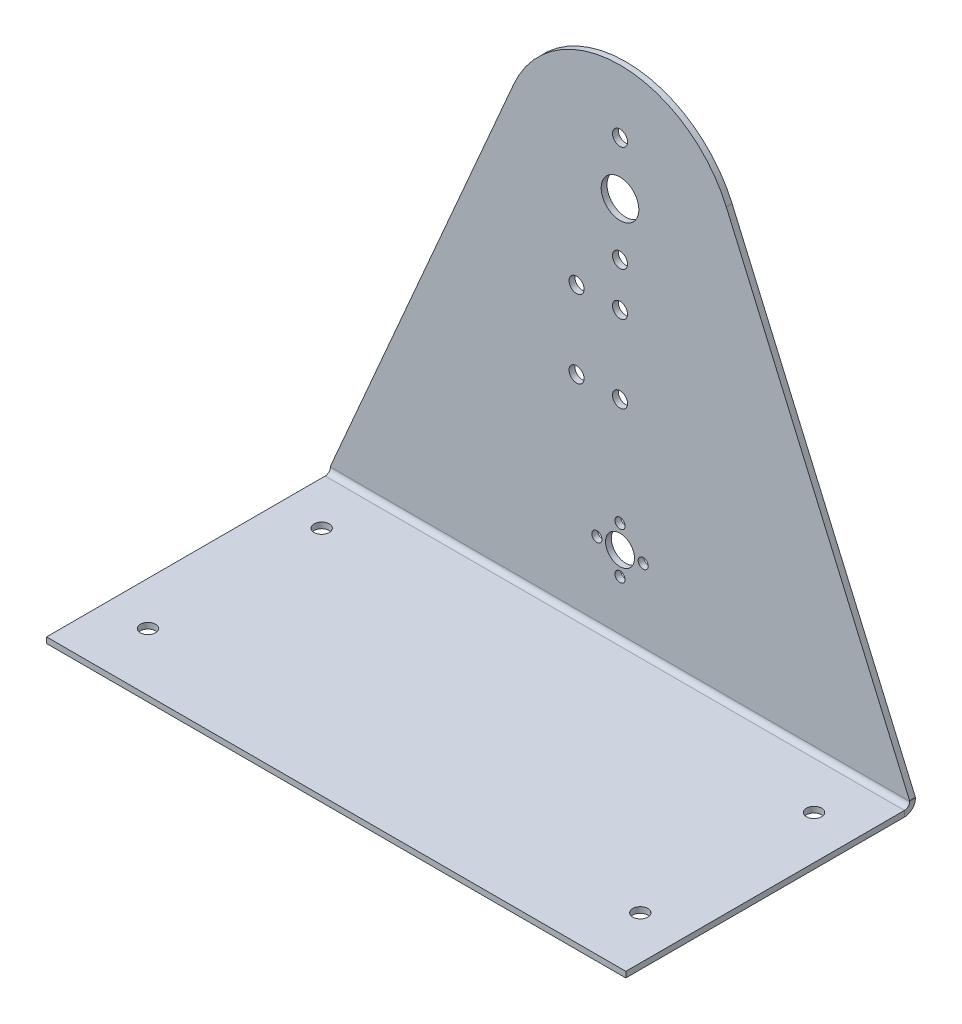
ISO-10303-21;
HEADER;
FILE_DESCRIPTION(('STEP AP214'),'2;1');
FILE_NAME('part.step','',(''),(''),'','','');
FILE_SCHEMA(('AUTOMOTIVE_DESIGN { 1 0 10303 214 1 1 1 1 }'));
ENDSEC;
DATA;
#1=APPLICATION_CONTEXT('core data for automotive mechanical design processes');
#2=APPLICATION_PROTOCOL_DEFINITION('international standard','automotive_design',2000,#1);
#3=PRODUCT_CONTEXT('',#1,'mechanical');
#4=PRODUCT('Part','Part','',(#3));
#5=PRODUCT_RELATED_PRODUCT_CATEGORY('part','',(#4));
#6=PRODUCT_DEFINITION_FORMATION('','',#4);
#7=PRODUCT_DEFINITION_CONTEXT('part definition',#1,'design');
#8=PRODUCT_DEFINITION('design','',#6,#7);
#9=PRODUCT_DEFINITION_SHAPE('','',#8);
#10=(LENGTH_UNIT() NAMED_UNIT(*) SI_UNIT(.MILLI.,.METRE.));
#11=(NAMED_UNIT(*) PLANE_ANGLE_UNIT() SI_UNIT($,.RADIAN.));
#12=(NAMED_UNIT(*) SI_UNIT($,.STERADIAN.) SOLID_ANGLE_UNIT());
#13=UNCERTAINTY_MEASURE_WITH_UNIT(LENGTH_MEASURE(1.E-05),#10,'distance_accuracy_value','');
#14=(GEOMETRIC_REPRESENTATION_CONTEXT(3) GLOBAL_UNCERTAINTY_ASSIGNED_CONTEXT((#13)) GLOBAL_UNIT_ASSIGNED_CONTEXT((#10,
#11,#12)) REPRESENTATION_CONTEXT('',''));
#15=CARTESIAN_POINT('',(0.,0.,0.));
#16=DIRECTION('',(0.,0.,1.));
#17=DIRECTION('',(1.,0.,0.));
#18=AXIS2_PLACEMENT_3D('',#15,#16,#17);
#19=CARTESIAN_POINT('',(-100.,0.,0.));
#20=DIRECTION('',(-1.,0.,0.));
#21=DIRECTION('',(0.,-1.,0.));
#22=AXIS2_PLACEMENT_3D('',#19,#20,#21);
#23=PLANE('',#22);
#24=DIRECTION('',(0.,0.,-1.));
#25=VECTOR('',#24,1.);
#26=CARTESIAN_POINT('',(-100.,-0.200000000000024,0.));
#27=LINE('',#26,#25);
#28=CARTESIAN_POINT('',(-100.,-0.200000000000025,2.));
#29=VERTEX_POINT('',#28);
#30=CARTESIAN_POINT('',(-100.,-0.200000000000024,0.));
#31=VERTEX_POINT('',#30);
#32=EDGE_CURVE('E11',#29,#31,#27,.T.);
#33=ORIENTED_EDGE('',*,*,#32,.F.);
#34=DIRECTION('',(0.,1.,0.));
#35=VECTOR('',#34,1.);
#36=CARTESIAN_POINT('',(-100.,0.,2.));
#37=LINE('',#36,#35);
#38=CARTESIAN_POINT('',(-100.,0.,2.));
#39=VERTEX_POINT('',#38);
#40=EDGE_CURVE('E104',#39,#29,#37,.F.);
#41=ORIENTED_EDGE('',*,*,#40,.F.);
#42=DIRECTION('',(0.,0.,-1.));
#43=VECTOR('',#42,1.);
#44=CARTESIAN_POINT('',(-100.,0.,0.));
#45=LINE('',#44,#43);
#46=CARTESIAN_POINT('',(-100.,0.,0.));
#47=VERTEX_POINT('',#46);
#48=EDGE_CURVE('E59',#39,#47,#45,.T.);
#49=ORIENTED_EDGE('',*,*,#48,.T.);
#50=DIRECTION('',(0.,-1.,0.));
#51=VECTOR('',#50,1.);
#52=CARTESIAN_POINT('',(-100.,0.,0.));
#53=LINE('',#52,#51);
#54=EDGE_CURVE('E106',#47,#31,#53,.T.);
#55=ORIENTED_EDGE('',*,*,#54,.T.);
#56=EDGE_LOOP('',(#33,#41,#49,#55));
#57=FACE_BOUND('',#56,.T.);
#58=ADVANCED_FACE('F49',(#57),#23,.T.);
#59=CARTESIAN_POINT('',(-84.1602695781019,36.5113130735037,0.));
#60=DIRECTION('',(0.917389064563678,-0.397991588125906,0.));
#61=DIRECTION('',(0.397991588125906,0.917389064563678,0.));
#62=AXIS2_PLACEMENT_3D('',#59,#60,#61);
#63=PLANE('',#62);
#64=ORIENTED_EDGE('',*,*,#48,.F.);
#65=DIRECTION('',(0.397991588125906,0.917389064563678,0.));
#66=VECTOR('',#65,1.);
#67=CARTESIAN_POINT('',(-84.1602695781019,36.5113130735037,2.));
#68=LINE('',#67,#66);
#69=CARTESIAN_POINT('',(-36.6955625825471,145.919663525036,2.));
#70=VERTEX_POINT('',#69);
#71=EDGE_CURVE('E131',#39,#70,#68,.T.);
#72=ORIENTED_EDGE('',*,*,#71,.T.);
#73=DIRECTION('',(0.,0.,-1.));
#74=VECTOR('',#73,1.);
#75=CARTESIAN_POINT('',(-36.6955625825471,145.919663525036,0.));
#76=LINE('',#75,#74);
#77=CARTESIAN_POINT('',(-36.6955625825471,145.919663525036,0.));
#78=VERTEX_POINT('',#77);
#79=EDGE_CURVE('E186',#70,#78,#76,.T.);
#80=ORIENTED_EDGE('',*,*,#79,.T.);
#81=DIRECTION('',(0.397991588125906,0.917389064563678,0.));
#82=VECTOR('',#81,1.);
#83=CARTESIAN_POINT('',(-84.1602695781019,36.5113130735037,0.));
#84=LINE('',#83,#82);
#85=EDGE_CURVE('E200',#47,#78,#84,.T.);
#86=ORIENTED_EDGE('',*,*,#85,.F.);
#87=EDGE_LOOP('',(#64,#72,#80,#86));
#88=FACE_BOUND('',#87,.T.);
#89=ADVANCED_FACE('F206',(#88),#63,.F.);
#90=CARTESIAN_POINT('',(0.,130.,0.));
#91=DIRECTION('',(0.,0.,1.));
#92=DIRECTION('',(1.,0.,0.));
#93=AXIS2_PLACEMENT_3D('',#90,#91,#92);
#94=CYLINDRICAL_SURFACE('',#93,40.);
#95=ORIENTED_EDGE('',*,*,#79,.F.);
#96=CARTESIAN_POINT('',(0.,130.,2.));
#97=DIRECTION('',(0.,0.,1.));
#98=DIRECTION('',(1.,0.,0.));
#99=AXIS2_PLACEMENT_3D('',#96,#97,#98);
#100=CIRCLE('',#99,40.);
#101=CARTESIAN_POINT('',(36.6955625825471,145.919663525036,2.));
#102=VERTEX_POINT('',#101);
#103=EDGE_CURVE('E248',#102,#70,#100,.T.);
#104=ORIENTED_EDGE('',*,*,#103,.F.);
#105=DIRECTION('',(0.,0.,-1.));
#106=VECTOR('',#105,1.);
#107=CARTESIAN_POINT('',(36.6955625825471,145.919663525036,0.));
#108=LINE('',#107,#106);
#109=CARTESIAN_POINT('',(36.6955625825471,145.919663525036,0.));
#110=VERTEX_POINT('',#109);
#111=EDGE_CURVE('E183',#102,#110,#108,.T.);
#112=ORIENTED_EDGE('',*,*,#111,.T.);
#113=CARTESIAN_POINT('',(0.,130.,0.));
#114=DIRECTION('',(0.,0.,1.));
#115=DIRECTION('',(1.,0.,0.));
#116=AXIS2_PLACEMENT_3D('',#113,#114,#115);
#117=CIRCLE('',#116,40.);
#118=EDGE_CURVE('E207',#110,#78,#117,.T.);
#119=ORIENTED_EDGE('',*,*,#118,.T.);
#120=EDGE_LOOP('',(#95,#104,#112,#119));
#121=FACE_BOUND('',#120,.T.);
#122=ADVANCED_FACE('F270',(#121),#94,.T.);
#123=CARTESIAN_POINT('',(84.1602695781019,36.5113130735037,0.));
#124=DIRECTION('',(0.917389064563678,0.397991588125906,0.));
#125=DIRECTION('',(-0.397991588125906,0.917389064563678,0.));
#126=AXIS2_PLACEMENT_3D('',#123,#124,#125);
#127=PLANE('',#126);
#128=ORIENTED_EDGE('',*,*,#111,.F.);
#129=DIRECTION('',(-0.397991588125906,0.917389064563678,0.));
#130=VECTOR('',#129,1.);
#131=CARTESIAN_POINT('',(84.1602695781019,36.5113130735037,2.));
#132=LINE('',#131,#130);
#133=CARTESIAN_POINT('',(100.,0.,2.));
#134=VERTEX_POINT('',#133);
#135=EDGE_CURVE('E168',#134,#102,#132,.T.);
#136=ORIENTED_EDGE('',*,*,#135,.F.);
#137=DIRECTION('',(0.,0.,-1.));
#138=VECTOR('',#137,1.);
#139=CARTESIAN_POINT('',(100.,0.,0.));
#140=LINE('',#139,#138);
#141=CARTESIAN_POINT('',(100.,0.,0.));
#142=VERTEX_POINT('',#141);
#143=EDGE_CURVE('E180',#134,#142,#140,.T.);
#144=ORIENTED_EDGE('',*,*,#143,.T.);
#145=DIRECTION('',(-0.397991588125906,0.917389064563678,0.));
#146=VECTOR('',#145,1.);
#147=CARTESIAN_POINT('',(84.1602695781019,36.5113130735037,0.));
#148=LINE('',#147,#146);
#149=EDGE_CURVE('E275',#142,#110,#148,.T.);
#150=ORIENTED_EDGE('',*,*,#149,.T.);
#151=EDGE_LOOP('',(#128,#136,#144,#150));
#152=FACE_BOUND('',#151,.T.);
#153=ADVANCED_FACE('F280',(#152),#127,.T.);
#154=CARTESIAN_POINT('',(100.,0.,0.));
#155=DIRECTION('',(-1.,0.,0.));
#156=DIRECTION('',(0.,-1.,0.));
#157=AXIS2_PLACEMENT_3D('',#154,#155,#156);
#158=PLANE('',#157);
#159=ORIENTED_EDGE('',*,*,#143,.F.);
#160=DIRECTION('',(0.,1.,0.));
#161=VECTOR('',#160,1.);
#162=CARTESIAN_POINT('',(100.,0.,2.));
#163=LINE('',#162,#161);
#164=CARTESIAN_POINT('',(100.,-0.199999999999964,2.));
#165=VERTEX_POINT('',#164);
#166=EDGE_CURVE('E132',#134,#165,#163,.F.);
#167=ORIENTED_EDGE('',*,*,#166,.T.);
#168=DIRECTION('',(0.,0.,-1.));
#169=VECTOR('',#168,1.);
#170=CARTESIAN_POINT('',(100.,-0.199999999999964,0.));
#171=LINE('',#170,#169);
#172=CARTESIAN_POINT('',(100.,-0.199999999999964,0.));
#173=VERTEX_POINT('',#172);
#174=EDGE_CURVE('E177',#165,#173,#171,.T.);
#175=ORIENTED_EDGE('',*,*,#174,.T.);
#176=DIRECTION('',(0.,-1.,0.));
#177=VECTOR('',#176,1.);
#178=CARTESIAN_POINT('',(100.,0.,0.));
#179=LINE('',#178,#177);
#180=EDGE_CURVE('E204',#142,#173,#179,.T.);
#181=ORIENTED_EDGE('',*,*,#180,.F.);
#182=EDGE_LOOP('',(#159,#167,#175,#181));
#183=FACE_BOUND('',#182,.T.);
#184=ADVANCED_FACE('F456',(#183),#158,.F.);
#185=CARTESIAN_POINT('',(100.,-0.199999999999964,3.8));
#186=DIRECTION('',(1.,0.,0.));
#187=DIRECTION('',(0.,0.,-1.));
#188=AXIS2_PLACEMENT_3D('',#185,#186,#187);
#189=PLANE('',#188);
#190=ORIENTED_EDGE('',*,*,#174,.F.);
#191=CARTESIAN_POINT('',(100.,-0.199999999999964,3.8));
#192=DIRECTION('',(1.,0.,0.));
#193=DIRECTION('',(0.,1.,0.));
#194=AXIS2_PLACEMENT_3D('',#191,#192,#193);
#195=CIRCLE('',#194,1.8);
#196=CARTESIAN_POINT('',(100.,-1.99999999999996,3.8));
#197=VERTEX_POINT('',#196);
#198=EDGE_CURVE('E120',#165,#197,#195,.F.);
#199=ORIENTED_EDGE('',*,*,#198,.T.);
#200=DIRECTION('',(0.,-1.,0.));
#201=VECTOR('',#200,1.);
#202=CARTESIAN_POINT('',(100.,-3.99999999999996,3.8));
#203=LINE('',#202,#201);
#204=CARTESIAN_POINT('',(100.,-3.99999999999996,3.8));
#205=VERTEX_POINT('',#204);
#206=EDGE_CURVE('E175',#197,#205,#203,.T.);
#207=ORIENTED_EDGE('',*,*,#206,.T.);
#208=CARTESIAN_POINT('',(100.,-0.199999999999964,3.8));
#209=DIRECTION('',(-1.,0.,0.));
#210=DIRECTION('',(0.,0.,1.));
#211=AXIS2_PLACEMENT_3D('',#208,#209,#210);
#212=CIRCLE('',#211,3.8);
#213=EDGE_CURVE('E239',#173,#205,#212,.T.);
#214=ORIENTED_EDGE('',*,*,#213,.F.);
#215=EDGE_LOOP('',(#190,#199,#207,#214));
#216=FACE_BOUND('',#215,.T.);
#217=ADVANCED_FACE('F452',(#216),#189,.T.);
#218=CARTESIAN_POINT('',(100.,-3.99999999999996,4.));
#219=DIRECTION('',(-1.,0.,0.));
#220=DIRECTION('',(0.,0.,-1.));
#221=AXIS2_PLACEMENT_3D('',#218,#219,#220);
#222=PLANE('',#221);
#223=ORIENTED_EDGE('',*,*,#206,.F.);
#224=DIRECTION('',(0.,0.,1.));
#225=VECTOR('',#224,1.);
#226=CARTESIAN_POINT('',(100.,-1.99999999999996,4.));
#227=LINE('',#226,#225);
#228=CARTESIAN_POINT('',(100.,-1.99999999999996,100.));
#229=VERTEX_POINT('',#228);
#230=EDGE_CURVE('E257',#229,#197,#227,.F.);
#231=ORIENTED_EDGE('',*,*,#230,.F.);
#232=DIRECTION('',(0.,-1.,0.));
#233=VECTOR('',#232,1.);
#234=CARTESIAN_POINT('',(100.,-3.99999999999996,100.));
#235=LINE('',#234,#233);
#236=CARTESIAN_POINT('',(100.,-3.99999999999996,100.));
#237=VERTEX_POINT('',#236);
#238=EDGE_CURVE('E172',#229,#237,#235,.T.);
#239=ORIENTED_EDGE('',*,*,#238,.T.);
#240=DIRECTION('',(0.,0.,-1.));
#241=VECTOR('',#240,1.);
#242=CARTESIAN_POINT('',(100.,-3.99999999999996,4.));
#243=LINE('',#242,#241);
#244=EDGE_CURVE('E224',#237,#205,#243,.T.);
#245=ORIENTED_EDGE('',*,*,#244,.T.);
#246=EDGE_LOOP('',(#223,#231,#239,#245));
#247=FACE_BOUND('',#246,.T.);
#248=ADVANCED_FACE('F448',(#247),#222,.F.);
#249=CARTESIAN_POINT('',(100.,-3.99999999999996,100.));
#250=DIRECTION('',(0.,0.,1.));
#251=DIRECTION('',(-1.,0.,0.));
#252=AXIS2_PLACEMENT_3D('',#249,#250,#251);
#253=PLANE('',#252);
#254=ORIENTED_EDGE('',*,*,#238,.F.);
#255=DIRECTION('',(1.,0.,0.));
#256=VECTOR('',#255,1.);
#257=CARTESIAN_POINT('',(100.,-1.99999999999996,100.));
#258=LINE('',#257,#256);
#259=CARTESIAN_POINT('',(-100.,-2.00000000000002,100.));
#260=VERTEX_POINT('',#259);
#261=EDGE_CURVE('E259',#229,#260,#258,.F.);
#262=ORIENTED_EDGE('',*,*,#261,.T.);
#263=DIRECTION('',(0.,-1.,0.));
#264=VECTOR('',#263,1.);
#265=CARTESIAN_POINT('',(-100.,-4.00000000000002,100.));
#266=LINE('',#265,#264);
#267=CARTESIAN_POINT('',(-100.,-4.00000000000002,100.));
#268=VERTEX_POINT('',#267);
#269=EDGE_CURVE('E169',#260,#268,#266,.T.);
#270=ORIENTED_EDGE('',*,*,#269,.T.);
#271=DIRECTION('',(-1.,0.,0.));
#272=VECTOR('',#271,1.);
#273=CARTESIAN_POINT('',(100.,-3.99999999999996,100.));
#274=LINE('',#273,#272);
#275=EDGE_CURVE('E227',#237,#268,#274,.T.);
#276=ORIENTED_EDGE('',*,*,#275,.F.);
#277=EDGE_LOOP('',(#254,#262,#270,#276));
#278=FACE_BOUND('',#277,.T.);
#279=ADVANCED_FACE('F445',(#278),#253,.T.);
#280=CARTESIAN_POINT('',(-100.,-4.00000000000002,4.));
#281=DIRECTION('',(-1.,0.,0.));
#282=DIRECTION('',(0.,0.,-1.));
#283=AXIS2_PLACEMENT_3D('',#280,#281,#282);
#284=PLANE('',#283);
#285=ORIENTED_EDGE('',*,*,#269,.F.);
#286=DIRECTION('',(0.,0.,1.));
#287=VECTOR('',#286,1.);
#288=CARTESIAN_POINT('',(-100.,-2.00000000000002,4.));
#289=LINE('',#288,#287);
#290=CARTESIAN_POINT('',(-100.,-2.00000000000002,3.8));
#291=VERTEX_POINT('',#290);
#292=EDGE_CURVE('E125',#260,#291,#289,.F.);
#293=ORIENTED_EDGE('',*,*,#292,.T.);
#294=DIRECTION('',(0.,-1.,0.));
#295=VECTOR('',#294,1.);
#296=CARTESIAN_POINT('',(-100.,-4.00000000000002,3.8));
#297=LINE('',#296,#295);
#298=CARTESIAN_POINT('',(-100.,-4.00000000000002,3.8));
#299=VERTEX_POINT('',#298);
#300=EDGE_CURVE('E53',#291,#299,#297,.T.);
#301=ORIENTED_EDGE('',*,*,#300,.T.);
#302=DIRECTION('',(0.,0.,-1.));
#303=VECTOR('',#302,1.);
#304=CARTESIAN_POINT('',(-100.,-4.00000000000002,4.));
#305=LINE('',#304,#303);
#306=EDGE_CURVE('E230',#268,#299,#305,.T.);
#307=ORIENTED_EDGE('',*,*,#306,.F.);
#308=EDGE_LOOP('',(#285,#293,#301,#307));
#309=FACE_BOUND('',#308,.T.);
#310=ADVANCED_FACE('F383',(#309),#284,.T.);
#311=CARTESIAN_POINT('',(0.,33.,0.));
#312=DIRECTION('',(0.,0.,1.));
#313=DIRECTION('',(1.,0.,0.));
#314=AXIS2_PLACEMENT_3D('',#311,#312,#313);
#315=CYLINDRICAL_SURFACE('',#314,1.75);
#316=CARTESIAN_POINT('',(0.,33.,0.));
#317=DIRECTION('',(0.,0.,1.));
#318=DIRECTION('',(1.,0.,0.));
#319=AXIS2_PLACEMENT_3D('',#316,#317,#318);
#320=CIRCLE('',#319,1.75);
#321=CARTESIAN_POINT('',(1.75,33.,0.));
#322=VERTEX_POINT('',#321);
#323=EDGE_CURVE('E242',#322,#322,#320,.T.);
#324=ORIENTED_EDGE('',*,*,#323,.F.);
#325=EDGE_LOOP('',(#324));
#326=FACE_BOUND('',#325,.T.);
#327=CARTESIAN_POINT('',(0.,33.,2.));
#328=DIRECTION('',(0.,0.,1.));
#329=DIRECTION('',(1.,0.,0.));
#330=AXIS2_PLACEMENT_3D('',#327,#328,#329);
#331=CIRCLE('',#330,1.75);
#332=CARTESIAN_POINT('',(1.75,33.,2.));
#333=VERTEX_POINT('',#332);
#334=EDGE_CURVE('E138',#333,#333,#331,.T.);
#335=ORIENTED_EDGE('',*,*,#334,.T.);
#336=EDGE_LOOP('',(#335));
#337=FACE_BOUND('',#336,.T.);
#338=ADVANCED_FACE('F379',(#326,#337),#315,.F.);
#339=CARTESIAN_POINT('',(0.,17.,0.));
#340=DIRECTION('',(0.,0.,1.));
#341=DIRECTION('',(1.,0.,0.));
#342=AXIS2_PLACEMENT_3D('',#339,#340,#341);
#343=CYLINDRICAL_SURFACE('',#342,1.75);
#344=CARTESIAN_POINT('',(0.,17.,0.));
#345=DIRECTION('',(0.,0.,1.));
#346=DIRECTION('',(1.,0.,0.));
#347=AXIS2_PLACEMENT_3D('',#344,#345,#346);
#348=CIRCLE('',#347,1.75);
#349=CARTESIAN_POINT('',(1.75,17.,0.));
#350=VERTEX_POINT('',#349);
#351=EDGE_CURVE('E301',#350,#350,#348,.T.);
#352=ORIENTED_EDGE('',*,*,#351,.F.);
#353=EDGE_LOOP('',(#352));
#354=FACE_BOUND('',#353,.T.);
#355=CARTESIAN_POINT('',(0.,17.,2.));
#356=DIRECTION('',(0.,0.,1.));
#357=DIRECTION('',(1.,0.,0.));
#358=AXIS2_PLACEMENT_3D('',#355,#356,#357);
#359=CIRCLE('',#358,1.75);
#360=CARTESIAN_POINT('',(1.75,17.,2.));
#361=VERTEX_POINT('',#360);
#362=EDGE_CURVE('E147',#361,#361,#359,.T.);
#363=ORIENTED_EDGE('',*,*,#362,.T.);
#364=EDGE_LOOP('',(#363));
#365=FACE_BOUND('',#364,.T.);
#366=ADVANCED_FACE('F382',(#354,#365),#343,.F.);
#367=CARTESIAN_POINT('',(8.,25.,0.));
#368=DIRECTION('',(0.,0.,1.));
#369=DIRECTION('',(1.,0.,0.));
#370=AXIS2_PLACEMENT_3D('',#367,#368,#369);
#371=CYLINDRICAL_SURFACE('',#370,1.75);
#372=CARTESIAN_POINT('',(8.,25.,0.));
#373=DIRECTION('',(0.,0.,1.));
#374=DIRECTION('',(1.,0.,0.));
#375=AXIS2_PLACEMENT_3D('',#372,#373,#374);
#376=CIRCLE('',#375,1.75);
#377=CARTESIAN_POINT('',(9.75,25.,0.));
#378=VERTEX_POINT('',#377);
#379=EDGE_CURVE('E298',#378,#378,#376,.T.);
#380=ORIENTED_EDGE('',*,*,#379,.F.);
#381=EDGE_LOOP('',(#380));
#382=FACE_BOUND('',#381,.T.);
#383=CARTESIAN_POINT('',(8.,25.,2.));
#384=DIRECTION('',(0.,0.,1.));
#385=DIRECTION('',(1.,0.,0.));
#386=AXIS2_PLACEMENT_3D('',#383,#384,#385);
#387=CIRCLE('',#386,1.75);
#388=CARTESIAN_POINT('',(9.75,25.,2.));
#389=VERTEX_POINT('',#388);
#390=EDGE_CURVE('E150',#389,#389,#387,.T.);
#391=ORIENTED_EDGE('',*,*,#390,.T.);
#392=EDGE_LOOP('',(#391));
#393=FACE_BOUND('',#392,.T.);
#394=ADVANCED_FACE('F387',(#382,#393),#371,.F.);
#395=CARTESIAN_POINT('',(-8.,25.,0.));
#396=DIRECTION('',(0.,0.,1.));
#397=DIRECTION('',(1.,0.,0.));
#398=AXIS2_PLACEMENT_3D('',#395,#396,#397);
#399=CYLINDRICAL_SURFACE('',#398,1.75);
#400=CARTESIAN_POINT('',(-8.,25.,0.));
#401=DIRECTION('',(0.,0.,1.));
#402=DIRECTION('',(1.,0.,0.));
#403=AXIS2_PLACEMENT_3D('',#400,#401,#402);
#404=CIRCLE('',#403,1.75);
#405=CARTESIAN_POINT('',(-6.25,25.,0.));
#406=VERTEX_POINT('',#405);
#407=EDGE_CURVE('E295',#406,#406,#404,.T.);
#408=ORIENTED_EDGE('',*,*,#407,.F.);
#409=EDGE_LOOP('',(#408));
#410=FACE_BOUND('',#409,.T.);
#411=CARTESIAN_POINT('',(-8.,25.,2.));
#412=DIRECTION('',(0.,0.,1.));
#413=DIRECTION('',(1.,0.,0.));
#414=AXIS2_PLACEMENT_3D('',#411,#412,#413);
#415=CIRCLE('',#414,1.75);
#416=CARTESIAN_POINT('',(-6.25,25.,2.));
#417=VERTEX_POINT('',#416);
#418=EDGE_CURVE('E153',#417,#417,#415,.T.);
#419=ORIENTED_EDGE('',*,*,#418,.T.);
#420=EDGE_LOOP('',(#419));
#421=FACE_BOUND('',#420,.T.);
#422=ADVANCED_FACE('F391',(#410,#421),#399,.F.);
#423=CARTESIAN_POINT('',(0.,25.,0.));
#424=DIRECTION('',(0.,0.,1.));
#425=DIRECTION('',(1.,0.,0.));
#426=AXIS2_PLACEMENT_3D('',#423,#424,#425);
#427=CYLINDRICAL_SURFACE('',#426,5.);
#428=CARTESIAN_POINT('',(0.,25.,0.));
#429=DIRECTION('',(0.,0.,1.));
#430=DIRECTION('',(1.,0.,0.));
#431=AXIS2_PLACEMENT_3D('',#428,#429,#430);
#432=CIRCLE('',#431,5.);
#433=CARTESIAN_POINT('',(5.,25.,0.));
#434=VERTEX_POINT('',#433);
#435=EDGE_CURVE('E292',#434,#434,#432,.T.);
#436=ORIENTED_EDGE('',*,*,#435,.F.);
#437=EDGE_LOOP('',(#436));
#438=FACE_BOUND('',#437,.T.);
#439=CARTESIAN_POINT('',(0.,25.,2.));
#440=DIRECTION('',(0.,0.,1.));
#441=DIRECTION('',(1.,0.,0.));
#442=AXIS2_PLACEMENT_3D('',#439,#440,#441);
#443=CIRCLE('',#442,5.);
#444=CARTESIAN_POINT('',(5.,25.,2.));
#445=VERTEX_POINT('',#444);
#446=EDGE_CURVE('E156',#445,#445,#443,.T.);
#447=ORIENTED_EDGE('',*,*,#446,.T.);
#448=EDGE_LOOP('',(#447));
#449=FACE_BOUND('',#448,.T.);
#450=ADVANCED_FACE('F395',(#438,#449),#427,.F.);
#451=CARTESIAN_POINT('',(0.,111.75,0.));
#452=DIRECTION('',(0.,0.,1.));
#453=DIRECTION('',(1.,0.,0.));
#454=AXIS2_PLACEMENT_3D('',#451,#452,#453);
#455=CYLINDRICAL_SURFACE('',#454,2.6);
#456=CARTESIAN_POINT('',(0.,111.75,0.));
#457=DIRECTION('',(0.,0.,-1.));
#458=DIRECTION('',(-1.,0.,0.));
#459=AXIS2_PLACEMENT_3D('',#456,#457,#458);
#460=CIRCLE('',#459,2.6);
#461=CARTESIAN_POINT('',(-2.6,111.75,0.));
#462=VERTEX_POINT('',#461);
#463=EDGE_CURVE('E289',#462,#462,#460,.T.);
#464=ORIENTED_EDGE('',*,*,#463,.T.);
#465=EDGE_LOOP('',(#464));
#466=FACE_BOUND('',#465,.T.);
#467=CARTESIAN_POINT('',(0.,111.75,2.));
#468=DIRECTION('',(0.,0.,-1.));
#469=DIRECTION('',(-1.,0.,0.));
#470=AXIS2_PLACEMENT_3D('',#467,#468,#469);
#471=CIRCLE('',#470,2.6);
#472=CARTESIAN_POINT('',(-2.6,111.75,2.));
#473=VERTEX_POINT('',#472);
#474=EDGE_CURVE('E159',#473,#473,#471,.T.);
#475=ORIENTED_EDGE('',*,*,#474,.F.);
#476=EDGE_LOOP('',(#475));
#477=FACE_BOUND('',#476,.T.);
#478=ADVANCED_FACE('F364',(#466,#477),#455,.F.);
#479=CARTESIAN_POINT('',(0.,148.25,0.));
#480=DIRECTION('',(0.,0.,1.));
#481=DIRECTION('',(1.,0.,0.));
#482=AXIS2_PLACEMENT_3D('',#479,#480,#481);
#483=CYLINDRICAL_SURFACE('',#482,2.59999999999999);
#484=CARTESIAN_POINT('',(0.,148.25,0.));
#485=DIRECTION('',(0.,0.,-1.));
#486=DIRECTION('',(-1.,0.,0.));
#487=AXIS2_PLACEMENT_3D('',#484,#485,#486);
#488=CIRCLE('',#487,2.59999999999999);
#489=CARTESIAN_POINT('',(-2.59999999999999,148.25,0.));
#490=VERTEX_POINT('',#489);
#491=EDGE_CURVE('E284',#490,#490,#488,.T.);
#492=ORIENTED_EDGE('',*,*,#491,.T.);
#493=EDGE_LOOP('',(#492));
#494=FACE_BOUND('',#493,.T.);
#495=CARTESIAN_POINT('',(0.,148.25,2.));
#496=DIRECTION('',(0.,0.,-1.));
#497=DIRECTION('',(-1.,0.,0.));
#498=AXIS2_PLACEMENT_3D('',#495,#496,#497);
#499=CIRCLE('',#498,2.59999999999999);
#500=CARTESIAN_POINT('',(-2.59999999999999,148.25,2.));
#501=VERTEX_POINT('',#500);
#502=EDGE_CURVE('E162',#501,#501,#499,.T.);
#503=ORIENTED_EDGE('',*,*,#502,.F.);
#504=EDGE_LOOP('',(#503));
#505=FACE_BOUND('',#504,.T.);
#506=ADVANCED_FACE('F355',(#494,#505),#483,.F.);
#507=CARTESIAN_POINT('',(0.,130.,0.));
#508=DIRECTION('',(0.,0.,1.));
#509=DIRECTION('',(1.,0.,0.));
#510=AXIS2_PLACEMENT_3D('',#507,#508,#509);
#511=CYLINDRICAL_SURFACE('',#510,6.50000000000001);
#512=CARTESIAN_POINT('',(0.,130.,0.));
#513=DIRECTION('',(0.,0.,1.));
#514=DIRECTION('',(1.,0.,0.));
#515=AXIS2_PLACEMENT_3D('',#512,#513,#514);
#516=CIRCLE('',#515,6.50000000000001);
#517=CARTESIAN_POINT('',(6.50000000000001,130.,0.));
#518=VERTEX_POINT('',#517);
#519=EDGE_CURVE('E281',#518,#518,#516,.T.);
#520=ORIENTED_EDGE('',*,*,#519,.F.);
#521=EDGE_LOOP('',(#520));
#522=FACE_BOUND('',#521,.T.);
#523=CARTESIAN_POINT('',(0.,130.,2.));
#524=DIRECTION('',(0.,0.,1.));
#525=DIRECTION('',(1.,0.,0.));
#526=AXIS2_PLACEMENT_3D('',#523,#524,#525);
#527=CIRCLE('',#526,6.50000000000001);
#528=CARTESIAN_POINT('',(6.50000000000001,130.,2.));
#529=VERTEX_POINT('',#528);
#530=EDGE_CURVE('E165',#529,#529,#527,.T.);
#531=ORIENTED_EDGE('',*,*,#530,.T.);
#532=EDGE_LOOP('',(#531));
#533=FACE_BOUND('',#532,.T.);
#534=ADVANCED_FACE('F51',(#522,#533),#511,.F.);
#535=CARTESIAN_POINT('',(-85.,-4.00000000000002,20.));
#536=DIRECTION('',(0.,-1.,0.));
#537=DIRECTION('',(1.,0.,0.));
#538=AXIS2_PLACEMENT_3D('',#535,#536,#537);
#539=CYLINDRICAL_SURFACE('',#538,2.6);
#540=CARTESIAN_POINT('',(-85.,-4.00000000000002,20.));
#541=DIRECTION('',(0.,-1.,0.));
#542=DIRECTION('',(1.,0.,0.));
#543=AXIS2_PLACEMENT_3D('',#540,#541,#542);
#544=CIRCLE('',#543,2.6);
#545=CARTESIAN_POINT('',(-82.4,-4.00000000000002,20.));
#546=VERTEX_POINT('',#545);
#547=EDGE_CURVE('E209',#546,#546,#544,.T.);
#548=ORIENTED_EDGE('',*,*,#547,.T.);
#549=EDGE_LOOP('',(#548));
#550=FACE_BOUND('',#549,.T.);
#551=CARTESIAN_POINT('',(-85.,-2.00000000000002,20.));
#552=DIRECTION('',(0.,-1.,0.));
#553=DIRECTION('',(1.,0.,0.));
#554=AXIS2_PLACEMENT_3D('',#551,#552,#553);
#555=CIRCLE('',#554,2.6);
#556=CARTESIAN_POINT('',(-82.4,-2.00000000000002,20.));
#557=VERTEX_POINT('',#556);
#558=EDGE_CURVE('E244',#557,#557,#555,.T.);
#559=ORIENTED_EDGE('',*,*,#558,.F.);
#560=EDGE_LOOP('',(#559));
#561=FACE_BOUND('',#560,.T.);
#562=ADVANCED_FACE('F354',(#550,#561),#539,.F.);
#563=CARTESIAN_POINT('',(85.,-3.99999999999996,80.));
#564=DIRECTION('',(0.,-1.,0.));
#565=DIRECTION('',(1.,0.,0.));
#566=AXIS2_PLACEMENT_3D('',#563,#564,#565);
#567=CYLINDRICAL_SURFACE('',#566,2.6);
#568=CARTESIAN_POINT('',(85.,-3.99999999999996,80.));
#569=DIRECTION('',(0.,-1.,0.));
#570=DIRECTION('',(1.,0.,0.));
#571=AXIS2_PLACEMENT_3D('',#568,#569,#570);
#572=CIRCLE('',#571,2.6);
#573=CARTESIAN_POINT('',(87.6,-3.99999999999996,80.));
#574=VERTEX_POINT('',#573);
#575=EDGE_CURVE('E215',#574,#574,#572,.T.);
#576=ORIENTED_EDGE('',*,*,#575,.T.);
#577=EDGE_LOOP('',(#576));
#578=FACE_BOUND('',#577,.T.);
#579=CARTESIAN_POINT('',(85.,-1.99999999999996,80.));
#580=DIRECTION('',(0.,-1.,0.));
#581=DIRECTION('',(1.,0.,0.));
#582=AXIS2_PLACEMENT_3D('',#579,#580,#581);
#583=CIRCLE('',#582,2.6);
#584=CARTESIAN_POINT('',(87.6,-1.99999999999996,80.));
#585=VERTEX_POINT('',#584);
#586=EDGE_CURVE('E247',#585,#585,#583,.T.);
#587=ORIENTED_EDGE('',*,*,#586,.F.);
#588=EDGE_LOOP('',(#587));
#589=FACE_BOUND('',#588,.T.);
#590=ADVANCED_FACE('F361',(#578,#589),#567,.F.);
#591=CARTESIAN_POINT('',(85.,-3.99999999999996,20.));
#592=DIRECTION('',(0.,-1.,0.));
#593=DIRECTION('',(1.,0.,0.));
#594=AXIS2_PLACEMENT_3D('',#591,#592,#593);
#595=CYLINDRICAL_SURFACE('',#594,2.6);
#596=CARTESIAN_POINT('',(85.,-3.99999999999996,20.));
#597=DIRECTION('',(0.,-1.,0.));
#598=DIRECTION('',(1.,0.,0.));
#599=AXIS2_PLACEMENT_3D('',#596,#597,#598);
#600=CIRCLE('',#599,2.6);
#601=CARTESIAN_POINT('',(87.6,-3.99999999999996,20.));
#602=VERTEX_POINT('',#601);
#603=EDGE_CURVE('E218',#602,#602,#600,.T.);
#604=ORIENTED_EDGE('',*,*,#603,.T.);
#605=EDGE_LOOP('',(#604));
#606=FACE_BOUND('',#605,.T.);
#607=CARTESIAN_POINT('',(85.,-1.99999999999996,20.));
#608=DIRECTION('',(0.,-1.,0.));
#609=DIRECTION('',(1.,0.,0.));
#610=AXIS2_PLACEMENT_3D('',#607,#608,#609);
#611=CIRCLE('',#610,2.6);
#612=CARTESIAN_POINT('',(87.6,-1.99999999999996,20.));
#613=VERTEX_POINT('',#612);
#614=EDGE_CURVE('E251',#613,#613,#611,.T.);
#615=ORIENTED_EDGE('',*,*,#614,.F.);
#616=EDGE_LOOP('',(#615));
#617=FACE_BOUND('',#616,.T.);
#618=ADVANCED_FACE('F435',(#606,#617),#595,.F.);
#619=CARTESIAN_POINT('',(-85.,-4.00000000000002,80.));
#620=DIRECTION('',(0.,-1.,0.));
#621=DIRECTION('',(1.,0.,0.));
#622=AXIS2_PLACEMENT_3D('',#619,#620,#621);
#623=CYLINDRICAL_SURFACE('',#622,2.6);
#624=CARTESIAN_POINT('',(-85.,-4.00000000000002,80.));
#625=DIRECTION('',(0.,-1.,0.));
#626=DIRECTION('',(1.,0.,0.));
#627=AXIS2_PLACEMENT_3D('',#624,#625,#626);
#628=CIRCLE('',#627,2.6);
#629=CARTESIAN_POINT('',(-82.4,-4.00000000000002,80.));
#630=VERTEX_POINT('',#629);
#631=EDGE_CURVE('E221',#630,#630,#628,.T.);
#632=ORIENTED_EDGE('',*,*,#631,.T.);
#633=EDGE_LOOP('',(#632));
#634=FACE_BOUND('',#633,.T.);
#635=CARTESIAN_POINT('',(-85.,-2.00000000000002,80.));
#636=DIRECTION('',(0.,-1.,0.));
#637=DIRECTION('',(1.,0.,0.));
#638=AXIS2_PLACEMENT_3D('',#635,#636,#637);
#639=CIRCLE('',#638,2.6);
#640=CARTESIAN_POINT('',(-82.4,-2.00000000000002,80.));
#641=VERTEX_POINT('',#640);
#642=EDGE_CURVE('E254',#641,#641,#639,.T.);
#643=ORIENTED_EDGE('',*,*,#642,.F.);
#644=EDGE_LOOP('',(#643));
#645=FACE_BOUND('',#644,.T.);
#646=ADVANCED_FACE('F378',(#634,#645),#623,.F.);
#647=CARTESIAN_POINT('',(-100.,-0.200000000000024,3.8));
#648=DIRECTION('',(-1.,0.,0.));
#649=DIRECTION('',(0.,0.,1.));
#650=AXIS2_PLACEMENT_3D('',#647,#648,#649);
#651=PLANE('',#650);
#652=CARTESIAN_POINT('',(-100.,-0.200000000000024,3.8));
#653=DIRECTION('',(1.,0.,0.));
#654=DIRECTION('',(0.,1.,0.));
#655=AXIS2_PLACEMENT_3D('',#652,#653,#654);
#656=CIRCLE('',#655,1.8);
#657=EDGE_CURVE('E118',#291,#29,#656,.T.);
#658=ORIENTED_EDGE('',*,*,#657,.T.);
#659=ORIENTED_EDGE('',*,*,#32,.T.);
#660=CARTESIAN_POINT('',(-100.,-0.200000000000024,3.8));
#661=DIRECTION('',(1.,0.,0.));
#662=DIRECTION('',(0.,0.,-1.));
#663=AXIS2_PLACEMENT_3D('',#660,#661,#662);
#664=CIRCLE('',#663,3.8);
#665=EDGE_CURVE('E237',#299,#31,#664,.T.);
#666=ORIENTED_EDGE('',*,*,#665,.F.);
#667=ORIENTED_EDGE('',*,*,#300,.F.);
#668=EDGE_LOOP('',(#658,#659,#666,#667));
#669=FACE_BOUND('',#668,.T.);
#670=ADVANCED_FACE('F134',(#669),#651,.T.);
#671=CARTESIAN_POINT('',(100.,-3.99999999999996,4.));
#672=DIRECTION('',(0.,-1.,0.));
#673=DIRECTION('',(1.,0.,0.));
#674=AXIS2_PLACEMENT_3D('',#671,#672,#673);
#675=PLANE('',#674);
#676=ORIENTED_EDGE('',*,*,#547,.F.);
#677=EDGE_LOOP('',(#676));
#678=FACE_BOUND('',#677,.T.);
#679=ORIENTED_EDGE('',*,*,#575,.F.);
#680=EDGE_LOOP('',(#679));
#681=FACE_BOUND('',#680,.T.);
#682=ORIENTED_EDGE('',*,*,#603,.F.);
#683=EDGE_LOOP('',(#682));
#684=FACE_BOUND('',#683,.T.);
#685=ORIENTED_EDGE('',*,*,#631,.F.);
#686=EDGE_LOOP('',(#685));
#687=FACE_BOUND('',#686,.T.);
#688=ORIENTED_EDGE('',*,*,#306,.T.);
#689=DIRECTION('',(-1.,0.,0.));
#690=VECTOR('',#689,1.);
#691=CARTESIAN_POINT('',(100.,-3.99999999999996,3.8));
#692=LINE('',#691,#690);
#693=EDGE_CURVE('E234',#299,#205,#692,.F.);
#694=ORIENTED_EDGE('',*,*,#693,.T.);
#695=ORIENTED_EDGE('',*,*,#244,.F.);
#696=ORIENTED_EDGE('',*,*,#275,.T.);
#697=EDGE_LOOP('',(#688,#694,#695,#696));
#698=FACE_BOUND('',#697,.T.);
#699=ADVANCED_FACE('F377',(#678,#681,#684,#687,#698),#675,.T.);
#700=CARTESIAN_POINT('',(0.,0.,0.));
#701=DIRECTION('',(0.,0.,1.));
#702=DIRECTION('',(1.,0.,0.));
#703=AXIS2_PLACEMENT_3D('',#700,#701,#702);
#704=PLANE('',#703);
#705=CARTESIAN_POINT('',(-15.,70.,0.));
#706=DIRECTION('',(0.,0.,1.));
#707=DIRECTION('',(1.,0.,0.));
#708=AXIS2_PLACEMENT_3D('',#705,#706,#707);
#709=CIRCLE('',#708,2.6);
#710=CARTESIAN_POINT('',(-12.4,70.,0.));
#711=VERTEX_POINT('',#710);
#712=EDGE_CURVE('E136',#711,#711,#709,.T.);
#713=ORIENTED_EDGE('',*,*,#712,.T.);
#714=EDGE_LOOP('',(#713));
#715=FACE_BOUND('',#714,.T.);
#716=CARTESIAN_POINT('',(0.,70.,0.));
#717=DIRECTION('',(0.,0.,1.));
#718=DIRECTION('',(1.,0.,0.));
#719=AXIS2_PLACEMENT_3D('',#716,#717,#718);
#720=CIRCLE('',#719,2.6);
#721=CARTESIAN_POINT('',(2.6,70.,0.));
#722=VERTEX_POINT('',#721);
#723=EDGE_CURVE('E141',#722,#722,#720,.T.);
#724=ORIENTED_EDGE('',*,*,#723,.T.);
#725=EDGE_LOOP('',(#724));
#726=FACE_BOUND('',#725,.T.);
#727=CARTESIAN_POINT('',(0.,96.75,0.));
#728=DIRECTION('',(0.,0.,1.));
#729=DIRECTION('',(1.,0.,0.));
#730=AXIS2_PLACEMENT_3D('',#727,#728,#729);
#731=CIRCLE('',#730,2.6);
#732=CARTESIAN_POINT('',(2.6,96.75,0.));
#733=VERTEX_POINT('',#732);
#734=EDGE_CURVE('E308',#733,#733,#731,.T.);
#735=ORIENTED_EDGE('',*,*,#734,.T.);
#736=EDGE_LOOP('',(#735));
#737=FACE_BOUND('',#736,.T.);
#738=CARTESIAN_POINT('',(-15.,96.75,0.));
#739=DIRECTION('',(0.,0.,1.));
#740=DIRECTION('',(1.,0.,0.));
#741=AXIS2_PLACEMENT_3D('',#738,#739,#740);
#742=CIRCLE('',#741,2.6);
#743=CARTESIAN_POINT('',(-12.4,96.75,0.));
#744=VERTEX_POINT('',#743);
#745=EDGE_CURVE('E311',#744,#744,#742,.T.);
#746=ORIENTED_EDGE('',*,*,#745,.T.);
#747=EDGE_LOOP('',(#746));
#748=FACE_BOUND('',#747,.T.);
#749=ORIENTED_EDGE('',*,*,#323,.T.);
#750=EDGE_LOOP('',(#749));
#751=FACE_BOUND('',#750,.T.);
#752=ORIENTED_EDGE('',*,*,#351,.T.);
#753=EDGE_LOOP('',(#752));
#754=FACE_BOUND('',#753,.T.);
#755=ORIENTED_EDGE('',*,*,#379,.T.);
#756=EDGE_LOOP('',(#755));
#757=FACE_BOUND('',#756,.T.);
#758=ORIENTED_EDGE('',*,*,#407,.T.);
#759=EDGE_LOOP('',(#758));
#760=FACE_BOUND('',#759,.T.);
#761=ORIENTED_EDGE('',*,*,#435,.T.);
#762=EDGE_LOOP('',(#761));
#763=FACE_BOUND('',#762,.T.);
#764=ORIENTED_EDGE('',*,*,#463,.F.);
#765=EDGE_LOOP('',(#764));
#766=FACE_BOUND('',#765,.T.);
#767=ORIENTED_EDGE('',*,*,#491,.F.);
#768=EDGE_LOOP('',(#767));
#769=FACE_BOUND('',#768,.T.);
#770=ORIENTED_EDGE('',*,*,#519,.T.);
#771=EDGE_LOOP('',(#770));
#772=FACE_BOUND('',#771,.T.);
#773=ORIENTED_EDGE('',*,*,#180,.T.);
#774=DIRECTION('',(-1.,0.,0.));
#775=VECTOR('',#774,1.);
#776=CARTESIAN_POINT('',(-100.,-0.200000000000024,0.));
#777=LINE('',#776,#775);
#778=EDGE_CURVE('E203',#173,#31,#777,.T.);
#779=ORIENTED_EDGE('',*,*,#778,.T.);
#780=ORIENTED_EDGE('',*,*,#54,.F.);
#781=ORIENTED_EDGE('',*,*,#85,.T.);
#782=ORIENTED_EDGE('',*,*,#118,.F.);
#783=ORIENTED_EDGE('',*,*,#149,.F.);
#784=EDGE_LOOP('',(#773,#779,#780,#781,#782,#783));
#785=FACE_BOUND('',#784,.T.);
#786=ADVANCED_FACE('F198',(#715,#726,#737,#748,#751,#754,#757,#760,#763,#766,#769,#772,#785),
#704,.F.);
#787=CARTESIAN_POINT('',(0.,-0.199999999999994,3.8));
#788=DIRECTION('',(1.,0.,0.));
#789=DIRECTION('',(0.,1.,0.));
#790=AXIS2_PLACEMENT_3D('',#787,#788,#789);
#791=CYLINDRICAL_SURFACE('',#790,3.8);
#792=ORIENTED_EDGE('',*,*,#213,.T.);
#793=ORIENTED_EDGE('',*,*,#693,.F.);
#794=ORIENTED_EDGE('',*,*,#665,.T.);
#795=ORIENTED_EDGE('',*,*,#778,.F.);
#796=EDGE_LOOP('',(#792,#793,#794,#795));
#797=FACE_BOUND('',#796,.T.);
#798=ADVANCED_FACE('F409',(#797),#791,.T.);
#799=CARTESIAN_POINT('',(100.,-1.99999999999996,4.));
#800=DIRECTION('',(0.,-1.,0.));
#801=DIRECTION('',(1.,0.,0.));
#802=AXIS2_PLACEMENT_3D('',#799,#800,#801);
#803=PLANE('',#802);
#804=ORIENTED_EDGE('',*,*,#558,.T.);
#805=EDGE_LOOP('',(#804));
#806=FACE_BOUND('',#805,.T.);
#807=ORIENTED_EDGE('',*,*,#586,.T.);
#808=EDGE_LOOP('',(#807));
#809=FACE_BOUND('',#808,.T.);
#810=ORIENTED_EDGE('',*,*,#614,.T.);
#811=EDGE_LOOP('',(#810));
#812=FACE_BOUND('',#811,.T.);
#813=ORIENTED_EDGE('',*,*,#642,.T.);
#814=EDGE_LOOP('',(#813));
#815=FACE_BOUND('',#814,.T.);
#816=ORIENTED_EDGE('',*,*,#292,.F.);
#817=ORIENTED_EDGE('',*,*,#261,.F.);
#818=ORIENTED_EDGE('',*,*,#230,.T.);
#819=DIRECTION('',(1.,0.,0.));
#820=VECTOR('',#819,1.);
#821=CARTESIAN_POINT('',(100.,-1.99999999999996,3.8));
#822=LINE('',#821,#820);
#823=EDGE_CURVE('E124',#291,#197,#822,.T.);
#824=ORIENTED_EDGE('',*,*,#823,.F.);
#825=EDGE_LOOP('',(#816,#817,#818,#824));
#826=FACE_BOUND('',#825,.T.);
#827=ADVANCED_FACE('F332',(#806,#809,#812,#815,#826),#803,.F.);
#828=CARTESIAN_POINT('',(0.,0.,2.));
#829=DIRECTION('',(0.,0.,1.));
#830=DIRECTION('',(1.,0.,0.));
#831=AXIS2_PLACEMENT_3D('',#828,#829,#830);
#832=PLANE('',#831);
#833=CARTESIAN_POINT('',(-15.,70.,2.));
#834=DIRECTION('',(0.,0.,1.));
#835=DIRECTION('',(1.,0.,0.));
#836=AXIS2_PLACEMENT_3D('',#833,#834,#835);
#837=CIRCLE('',#836,2.6);
#838=CARTESIAN_POINT('',(-12.4,70.,2.));
#839=VERTEX_POINT('',#838);
#840=EDGE_CURVE('E318',#839,#839,#837,.T.);
#841=ORIENTED_EDGE('',*,*,#840,.F.);
#842=EDGE_LOOP('',(#841));
#843=FACE_BOUND('',#842,.T.);
#844=CARTESIAN_POINT('',(0.,70.,2.));
#845=DIRECTION('',(0.,0.,1.));
#846=DIRECTION('',(1.,0.,0.));
#847=AXIS2_PLACEMENT_3D('',#844,#845,#846);
#848=CIRCLE('',#847,2.6);
#849=CARTESIAN_POINT('',(2.6,70.,2.));
#850=VERTEX_POINT('',#849);
#851=EDGE_CURVE('E321',#850,#850,#848,.T.);
#852=ORIENTED_EDGE('',*,*,#851,.F.);
#853=EDGE_LOOP('',(#852));
#854=FACE_BOUND('',#853,.T.);
#855=CARTESIAN_POINT('',(0.,96.75,2.));
#856=DIRECTION('',(0.,0.,1.));
#857=DIRECTION('',(1.,0.,0.));
#858=AXIS2_PLACEMENT_3D('',#855,#856,#857);
#859=CIRCLE('',#858,2.6);
#860=CARTESIAN_POINT('',(2.6,96.75,2.));
#861=VERTEX_POINT('',#860);
#862=EDGE_CURVE('E317',#861,#861,#859,.T.);
#863=ORIENTED_EDGE('',*,*,#862,.F.);
#864=EDGE_LOOP('',(#863));
#865=FACE_BOUND('',#864,.T.);
#866=CARTESIAN_POINT('',(-15.,96.75,2.));
#867=DIRECTION('',(0.,0.,1.));
#868=DIRECTION('',(1.,0.,0.));
#869=AXIS2_PLACEMENT_3D('',#866,#867,#868);
#870=CIRCLE('',#869,2.6);
#871=CARTESIAN_POINT('',(-12.4,96.75,2.));
#872=VERTEX_POINT('',#871);
#873=EDGE_CURVE('E314',#872,#872,#870,.T.);
#874=ORIENTED_EDGE('',*,*,#873,.F.);
#875=EDGE_LOOP('',(#874));
#876=FACE_BOUND('',#875,.T.);
#877=ORIENTED_EDGE('',*,*,#334,.F.);
#878=EDGE_LOOP('',(#877));
#879=FACE_BOUND('',#878,.T.);
#880=ORIENTED_EDGE('',*,*,#362,.F.);
#881=EDGE_LOOP('',(#880));
#882=FACE_BOUND('',#881,.T.);
#883=ORIENTED_EDGE('',*,*,#390,.F.);
#884=EDGE_LOOP('',(#883));
#885=FACE_BOUND('',#884,.T.);
#886=ORIENTED_EDGE('',*,*,#418,.F.);
#887=EDGE_LOOP('',(#886));
#888=FACE_BOUND('',#887,.T.);
#889=ORIENTED_EDGE('',*,*,#446,.F.);
#890=EDGE_LOOP('',(#889));
#891=FACE_BOUND('',#890,.T.);
#892=ORIENTED_EDGE('',*,*,#474,.T.);
#893=EDGE_LOOP('',(#892));
#894=FACE_BOUND('',#893,.T.);
#895=ORIENTED_EDGE('',*,*,#502,.T.);
#896=EDGE_LOOP('',(#895));
#897=FACE_BOUND('',#896,.T.);
#898=ORIENTED_EDGE('',*,*,#530,.F.);
#899=EDGE_LOOP('',(#898));
#900=FACE_BOUND('',#899,.T.);
#901=ORIENTED_EDGE('',*,*,#166,.F.);
#902=ORIENTED_EDGE('',*,*,#135,.T.);
#903=ORIENTED_EDGE('',*,*,#103,.T.);
#904=ORIENTED_EDGE('',*,*,#71,.F.);
#905=ORIENTED_EDGE('',*,*,#40,.T.);
#906=DIRECTION('',(1.,0.,0.));
#907=VECTOR('',#906,1.);
#908=CARTESIAN_POINT('',(0.,-0.199999999999964,2.));
#909=LINE('',#908,#907);
#910=EDGE_CURVE('E115',#165,#29,#909,.F.);
#911=ORIENTED_EDGE('',*,*,#910,.F.);
#912=EDGE_LOOP('',(#901,#902,#903,#904,#905,#911));
#913=FACE_BOUND('',#912,.T.);
#914=ADVANCED_FACE('F128',(#843,#854,#865,#876,#879,#882,#885,#888,#891,#894,#897,#900,#913),
#832,.T.);
#915=CARTESIAN_POINT('',(0.,-0.199999999999994,3.8));
#916=DIRECTION('',(1.,0.,0.));
#917=DIRECTION('',(0.,1.,0.));
#918=AXIS2_PLACEMENT_3D('',#915,#916,#917);
#919=CYLINDRICAL_SURFACE('',#918,1.8);
#920=ORIENTED_EDGE('',*,*,#198,.F.);
#921=ORIENTED_EDGE('',*,*,#910,.T.);
#922=ORIENTED_EDGE('',*,*,#657,.F.);
#923=ORIENTED_EDGE('',*,*,#823,.T.);
#924=EDGE_LOOP('',(#920,#921,#922,#923));
#925=FACE_BOUND('',#924,.T.);
#926=ADVANCED_FACE('F116',(#925),#919,.F.);
#927=CARTESIAN_POINT('',(-15.,96.75,-8.));
#928=DIRECTION('',(0.,0.,1.));
#929=DIRECTION('',(1.,0.,0.));
#930=AXIS2_PLACEMENT_3D('',#927,#928,#929);
#931=CYLINDRICAL_SURFACE('',#930,2.6);
#932=ORIENTED_EDGE('',*,*,#873,.T.);
#933=EDGE_LOOP('',(#932));
#934=FACE_BOUND('',#933,.T.);
#935=ORIENTED_EDGE('',*,*,#745,.F.);
#936=EDGE_LOOP('',(#935));
#937=FACE_BOUND('',#936,.T.);
#938=ADVANCED_FACE('F425',(#934,#937),#931,.F.);
#939=CARTESIAN_POINT('',(0.,96.75,-8.));
#940=DIRECTION('',(0.,0.,1.));
#941=DIRECTION('',(1.,0.,0.));
#942=AXIS2_PLACEMENT_3D('',#939,#940,#941);
#943=CYLINDRICAL_SURFACE('',#942,2.6);
#944=ORIENTED_EDGE('',*,*,#862,.T.);
#945=EDGE_LOOP('',(#944));
#946=FACE_BOUND('',#945,.T.);
#947=ORIENTED_EDGE('',*,*,#734,.F.);
#948=EDGE_LOOP('',(#947));
#949=FACE_BOUND('',#948,.T.);
#950=ADVANCED_FACE('F327',(#946,#949),#943,.F.);
#951=CARTESIAN_POINT('',(0.,70.,-8.));
#952=DIRECTION('',(0.,0.,1.));
#953=DIRECTION('',(1.,0.,0.));
#954=AXIS2_PLACEMENT_3D('',#951,#952,#953);
#955=CYLINDRICAL_SURFACE('',#954,2.6);
#956=ORIENTED_EDGE('',*,*,#851,.T.);
#957=EDGE_LOOP('',(#956));
#958=FACE_BOUND('',#957,.T.);
#959=ORIENTED_EDGE('',*,*,#723,.F.);
#960=EDGE_LOOP('',(#959));
#961=FACE_BOUND('',#960,.T.);
#962=ADVANCED_FACE('F622',(#958,#961),#955,.F.);
#963=CARTESIAN_POINT('',(-15.,70.,-8.));
#964=DIRECTION('',(0.,0.,1.));
#965=DIRECTION('',(1.,0.,0.));
#966=AXIS2_PLACEMENT_3D('',#963,#964,#965);
#967=CYLINDRICAL_SURFACE('',#966,2.6);
#968=ORIENTED_EDGE('',*,*,#840,.T.);
#969=EDGE_LOOP('',(#968));
#970=FACE_BOUND('',#969,.T.);
#971=ORIENTED_EDGE('',*,*,#712,.F.);
#972=EDGE_LOOP('',(#971));
#973=FACE_BOUND('',#972,.T.);
#974=ADVANCED_FACE('F632',(#970,#973),#967,.F.);
#975=CLOSED_SHELL('',(#58,#89,#122,#153,#184,#217,#248,#279,#310,#338,#366,#394,#422,#450,#478,
#506,#534,#562,#590,#618,#646,#670,#699,#786,#798,#827,#914,#926,#938,#950,#962,#974));
#976=MANIFOLD_SOLID_BREP('B2',#975);
#977=ADVANCED_BREP_SHAPE_REPRESENTATION('',(#18,#976),#14);
#978=SHAPE_DEFINITION_REPRESENTATION(#9,#977);
ENDSEC;
END-ISO-10303-21;
